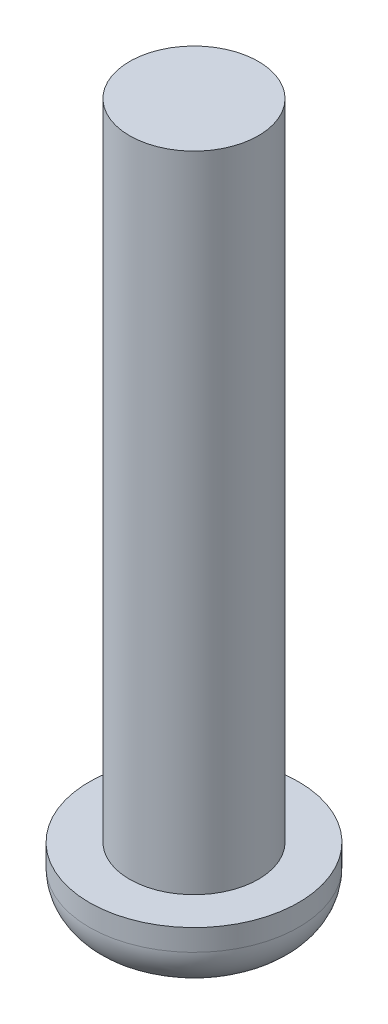
ISO-10303-21;
HEADER;
FILE_DESCRIPTION(('STEP AP214'),'2;1');
FILE_NAME('part.step','',(''),(''),'','','');
FILE_SCHEMA(('AUTOMOTIVE_DESIGN { 1 0 10303 214 1 1 1 1 }'));
ENDSEC;
DATA;
#1=APPLICATION_CONTEXT('core data for automotive mechanical design processes');
#2=APPLICATION_PROTOCOL_DEFINITION('international standard','automotive_design',2000,#1);
#3=PRODUCT_CONTEXT('',#1,'mechanical');
#4=PRODUCT('Part','Part','',(#3));
#5=PRODUCT_RELATED_PRODUCT_CATEGORY('part','',(#4));
#6=PRODUCT_DEFINITION_FORMATION('','',#4);
#7=PRODUCT_DEFINITION_CONTEXT('part definition',#1,'design');
#8=PRODUCT_DEFINITION('design','',#6,#7);
#9=PRODUCT_DEFINITION_SHAPE('','',#8);
#10=(LENGTH_UNIT() NAMED_UNIT(*) SI_UNIT(.MILLI.,.METRE.));
#11=(NAMED_UNIT(*) PLANE_ANGLE_UNIT() SI_UNIT($,.RADIAN.));
#12=(NAMED_UNIT(*) SI_UNIT($,.STERADIAN.) SOLID_ANGLE_UNIT());
#13=UNCERTAINTY_MEASURE_WITH_UNIT(LENGTH_MEASURE(1.E-05),#10,'distance_accuracy_value','');
#14=(GEOMETRIC_REPRESENTATION_CONTEXT(3) GLOBAL_UNCERTAINTY_ASSIGNED_CONTEXT((#13)) GLOBAL_UNIT_ASSIGNED_CONTEXT((#10,
#11,#12)) REPRESENTATION_CONTEXT('',''));
#15=CARTESIAN_POINT('',(0.,0.,0.));
#16=DIRECTION('',(0.,0.,1.));
#17=DIRECTION('',(1.,0.,0.));
#18=AXIS2_PLACEMENT_3D('',#15,#16,#17);
#19=CARTESIAN_POINT('',(30.,4.,0.));
#20=DIRECTION('',(0.,-1.,0.));
#21=DIRECTION('',(0.,0.,-1.));
#22=AXIS2_PLACEMENT_3D('',#19,#20,#21);
#23=CYLINDRICAL_SURFACE('',#22,6.5);
#24=CARTESIAN_POINT('',(30.,2.66666666666668,0.));
#25=DIRECTION('',(0.,-1.,0.));
#26=DIRECTION('',(0.,0.,-1.));
#27=AXIS2_PLACEMENT_3D('',#24,#25,#26);
#28=CIRCLE('',#27,6.5);
#29=CARTESIAN_POINT('',(30.,2.66666666666668,-6.5));
#30=VERTEX_POINT('',#29);
#31=EDGE_CURVE('E11',#30,#30,#28,.F.);
#32=ORIENTED_EDGE('',*,*,#31,.T.);
#33=EDGE_LOOP('',(#32));
#34=FACE_BOUND('',#33,.T.);
#35=CARTESIAN_POINT('',(30.,4.,0.));
#36=DIRECTION('',(0.,-1.,0.));
#37=DIRECTION('',(0.,0.,-1.));
#38=AXIS2_PLACEMENT_3D('',#35,#36,#37);
#39=CIRCLE('',#38,6.5);
#40=CARTESIAN_POINT('',(30.,4.,-6.5));
#41=VERTEX_POINT('',#40);
#42=EDGE_CURVE('E144',#41,#41,#39,.T.);
#43=ORIENTED_EDGE('',*,*,#42,.T.);
#44=EDGE_LOOP('',(#43));
#45=FACE_BOUND('',#44,.T.);
#46=ADVANCED_FACE('F33',(#34,#45),#23,.T.);
#47=CARTESIAN_POINT('',(36.5,4.,0.));
#48=DIRECTION('',(0.,1.,0.));
#49=DIRECTION('',(0.,0.,1.));
#50=AXIS2_PLACEMENT_3D('',#47,#48,#49);
#51=PLANE('',#50);
#52=CARTESIAN_POINT('',(30.,4.,0.));
#53=DIRECTION('',(0.,1.,0.));
#54=DIRECTION('',(0.,0.,1.));
#55=AXIS2_PLACEMENT_3D('',#52,#53,#54);
#56=CIRCLE('',#55,4.);
#57=CARTESIAN_POINT('',(30.,4.,4.));
#58=VERTEX_POINT('',#57);
#59=EDGE_CURVE('E135',#58,#58,#56,.T.);
#60=ORIENTED_EDGE('',*,*,#59,.F.);
#61=EDGE_LOOP('',(#60));
#62=FACE_BOUND('',#61,.T.);
#63=ORIENTED_EDGE('',*,*,#42,.F.);
#64=EDGE_LOOP('',(#63));
#65=FACE_BOUND('',#64,.T.);
#66=ADVANCED_FACE('F163',(#62,#65),#51,.T.);
#67=CARTESIAN_POINT('',(30.,0.,0.));
#68=DIRECTION('',(0.,-1.,0.));
#69=DIRECTION('',(0.,0.,-1.));
#70=AXIS2_PLACEMENT_3D('',#67,#68,#69);
#71=PLANE('',#70);
#72=CARTESIAN_POINT('',(30.,0.,0.));
#73=DIRECTION('',(0.,-1.,0.));
#74=DIRECTION('',(0.,0.,-1.));
#75=AXIS2_PLACEMENT_3D('',#72,#73,#74);
#76=CIRCLE('',#75,3.83333333333332);
#77=CARTESIAN_POINT('',(30.,0.,-3.83333333333332));
#78=VERTEX_POINT('',#77);
#79=EDGE_CURVE('E41',#78,#78,#76,.T.);
#80=ORIENTED_EDGE('',*,*,#79,.T.);
#81=EDGE_LOOP('',(#80));
#82=FACE_BOUND('',#81,.T.);
#83=DIRECTION('',(0.5,0.,-0.866025403784438));
#84=VECTOR('',#83,1.);
#85=CARTESIAN_POINT('',(27.5,0.,0.));
#86=LINE('',#85,#84);
#87=CARTESIAN_POINT('',(27.5,0.,0.));
#88=VERTEX_POINT('',#87);
#89=CARTESIAN_POINT('',(28.75,0.,-2.1650635094611));
#90=VERTEX_POINT('',#89);
#91=EDGE_CURVE('E48',#88,#90,#86,.T.);
#92=ORIENTED_EDGE('',*,*,#91,.F.);
#93=DIRECTION('',(-0.499999999999999,0.,-0.866025403784439));
#94=VECTOR('',#93,1.);
#95=CARTESIAN_POINT('',(28.75,0.,2.1650635094611));
#96=LINE('',#95,#94);
#97=CARTESIAN_POINT('',(28.75,0.,2.1650635094611));
#98=VERTEX_POINT('',#97);
#99=EDGE_CURVE('E131',#98,#88,#96,.T.);
#100=ORIENTED_EDGE('',*,*,#99,.F.);
#101=DIRECTION('',(-1.,0.,0.));
#102=VECTOR('',#101,1.);
#103=CARTESIAN_POINT('',(31.25,0.,2.1650635094611));
#104=LINE('',#103,#102);
#105=CARTESIAN_POINT('',(31.25,0.,2.1650635094611));
#106=VERTEX_POINT('',#105);
#107=EDGE_CURVE('E129',#106,#98,#104,.T.);
#108=ORIENTED_EDGE('',*,*,#107,.F.);
#109=DIRECTION('',(-0.5,0.,0.866025403784438));
#110=VECTOR('',#109,1.);
#111=CARTESIAN_POINT('',(32.5,0.,0.));
#112=LINE('',#111,#110);
#113=CARTESIAN_POINT('',(32.5,0.,0.));
#114=VERTEX_POINT('',#113);
#115=EDGE_CURVE('E96',#114,#106,#112,.T.);
#116=ORIENTED_EDGE('',*,*,#115,.F.);
#117=DIRECTION('',(0.499999999999999,0.,0.866025403784439));
#118=VECTOR('',#117,1.);
#119=CARTESIAN_POINT('',(31.25,0.,-2.1650635094611));
#120=LINE('',#119,#118);
#121=CARTESIAN_POINT('',(31.25,0.,-2.1650635094611));
#122=VERTEX_POINT('',#121);
#123=EDGE_CURVE('E125',#122,#114,#120,.T.);
#124=ORIENTED_EDGE('',*,*,#123,.F.);
#125=DIRECTION('',(1.,0.,0.));
#126=VECTOR('',#125,1.);
#127=CARTESIAN_POINT('',(28.75,0.,-2.1650635094611));
#128=LINE('',#127,#126);
#129=EDGE_CURVE('E122',#90,#122,#128,.T.);
#130=ORIENTED_EDGE('',*,*,#129,.F.);
#131=EDGE_LOOP('',(#92,#100,#108,#116,#124,#130));
#132=FACE_BOUND('',#131,.T.);
#133=ADVANCED_FACE('F151',(#82,#132),#71,.T.);
#134=CARTESIAN_POINT('',(30.,44.,0.));
#135=DIRECTION('',(0.,-1.,0.));
#136=DIRECTION('',(0.,0.,-1.));
#137=AXIS2_PLACEMENT_3D('',#134,#135,#136);
#138=CYLINDRICAL_SURFACE('',#137,4.);
#139=CARTESIAN_POINT('',(30.,44.,0.));
#140=DIRECTION('',(0.,1.,0.));
#141=DIRECTION('',(0.,0.,1.));
#142=AXIS2_PLACEMENT_3D('',#139,#140,#141);
#143=CIRCLE('',#142,4.);
#144=CARTESIAN_POINT('',(30.,44.,4.));
#145=VERTEX_POINT('',#144);
#146=EDGE_CURVE('E141',#145,#145,#143,.T.);
#147=ORIENTED_EDGE('',*,*,#146,.F.);
#148=EDGE_LOOP('',(#147));
#149=FACE_BOUND('',#148,.T.);
#150=ORIENTED_EDGE('',*,*,#59,.T.);
#151=EDGE_LOOP('',(#150));
#152=FACE_BOUND('',#151,.T.);
#153=ADVANCED_FACE('F174',(#149,#152),#138,.T.);
#154=CARTESIAN_POINT('',(30.,44.,0.));
#155=DIRECTION('',(0.,1.,0.));
#156=DIRECTION('',(0.,0.,1.));
#157=AXIS2_PLACEMENT_3D('',#154,#155,#156);
#158=PLANE('',#157);
#159=ORIENTED_EDGE('',*,*,#146,.T.);
#160=EDGE_LOOP('',(#159));
#161=FACE_BOUND('',#160,.T.);
#162=ADVANCED_FACE('F177',(#161),#158,.T.);
#163=CARTESIAN_POINT('',(27.5,2.,0.));
#164=DIRECTION('',(-0.866025403784438,0.,-0.5));
#165=DIRECTION('',(-0.5,0.,0.866025403784438));
#166=AXIS2_PLACEMENT_3D('',#163,#164,#165);
#167=PLANE('',#166);
#168=ORIENTED_EDGE('',*,*,#91,.T.);
#169=DIRECTION('',(0.,-1.,0.));
#170=VECTOR('',#169,1.);
#171=CARTESIAN_POINT('',(28.75,2.,-2.1650635094611));
#172=LINE('',#171,#170);
#173=CARTESIAN_POINT('',(28.75,2.,-2.1650635094611));
#174=VERTEX_POINT('',#173);
#175=EDGE_CURVE('E78',#174,#90,#172,.T.);
#176=ORIENTED_EDGE('',*,*,#175,.F.);
#177=DIRECTION('',(0.5,0.,-0.866025403784438));
#178=VECTOR('',#177,1.);
#179=CARTESIAN_POINT('',(27.5,2.,0.));
#180=LINE('',#179,#178);
#181=CARTESIAN_POINT('',(27.5,2.,0.));
#182=VERTEX_POINT('',#181);
#183=EDGE_CURVE('E133',#182,#174,#180,.T.);
#184=ORIENTED_EDGE('',*,*,#183,.F.);
#185=DIRECTION('',(0.,-1.,0.));
#186=VECTOR('',#185,1.);
#187=CARTESIAN_POINT('',(27.5,2.,0.));
#188=LINE('',#187,#186);
#189=EDGE_CURVE('E56',#182,#88,#188,.T.);
#190=ORIENTED_EDGE('',*,*,#189,.T.);
#191=EDGE_LOOP('',(#168,#176,#184,#190));
#192=FACE_BOUND('',#191,.T.);
#193=ADVANCED_FACE('F181',(#192),#167,.F.);
#194=CARTESIAN_POINT('',(28.75,2.,2.1650635094611));
#195=DIRECTION('',(-0.866025403784439,0.,0.499999999999999));
#196=DIRECTION('',(0.499999999999999,0.,0.866025403784439));
#197=AXIS2_PLACEMENT_3D('',#194,#195,#196);
#198=PLANE('',#197);
#199=ORIENTED_EDGE('',*,*,#99,.T.);
#200=ORIENTED_EDGE('',*,*,#189,.F.);
#201=DIRECTION('',(-0.499999999999999,0.,-0.866025403784439));
#202=VECTOR('',#201,1.);
#203=CARTESIAN_POINT('',(28.75,2.,2.1650635094611));
#204=LINE('',#203,#202);
#205=CARTESIAN_POINT('',(28.75,2.,2.1650635094611));
#206=VERTEX_POINT('',#205);
#207=EDGE_CURVE('E108',#206,#182,#204,.T.);
#208=ORIENTED_EDGE('',*,*,#207,.F.);
#209=DIRECTION('',(0.,-1.,0.));
#210=VECTOR('',#209,1.);
#211=CARTESIAN_POINT('',(28.75,2.,2.1650635094611));
#212=LINE('',#211,#210);
#213=EDGE_CURVE('E100',#206,#98,#212,.T.);
#214=ORIENTED_EDGE('',*,*,#213,.T.);
#215=EDGE_LOOP('',(#199,#200,#208,#214));
#216=FACE_BOUND('',#215,.T.);
#217=ADVANCED_FACE('F185',(#216),#198,.F.);
#218=CARTESIAN_POINT('',(31.25,2.,2.1650635094611));
#219=DIRECTION('',(0.,0.,1.));
#220=DIRECTION('',(1.,0.,0.));
#221=AXIS2_PLACEMENT_3D('',#218,#219,#220);
#222=PLANE('',#221);
#223=ORIENTED_EDGE('',*,*,#107,.T.);
#224=ORIENTED_EDGE('',*,*,#213,.F.);
#225=DIRECTION('',(-1.,0.,0.));
#226=VECTOR('',#225,1.);
#227=CARTESIAN_POINT('',(31.25,2.,2.1650635094611));
#228=LINE('',#227,#226);
#229=CARTESIAN_POINT('',(31.25,2.,2.1650635094611));
#230=VERTEX_POINT('',#229);
#231=EDGE_CURVE('E104',#230,#206,#228,.T.);
#232=ORIENTED_EDGE('',*,*,#231,.F.);
#233=DIRECTION('',(0.,-1.,0.));
#234=VECTOR('',#233,1.);
#235=CARTESIAN_POINT('',(31.25,2.,2.1650635094611));
#236=LINE('',#235,#234);
#237=EDGE_CURVE('E89',#230,#106,#236,.T.);
#238=ORIENTED_EDGE('',*,*,#237,.T.);
#239=EDGE_LOOP('',(#223,#224,#232,#238));
#240=FACE_BOUND('',#239,.T.);
#241=ADVANCED_FACE('F105',(#240),#222,.F.);
#242=CARTESIAN_POINT('',(32.5,2.,0.));
#243=DIRECTION('',(0.866025403784439,0.,0.5));
#244=DIRECTION('',(0.5,0.,-0.866025403784438));
#245=AXIS2_PLACEMENT_3D('',#242,#243,#244);
#246=PLANE('',#245);
#247=ORIENTED_EDGE('',*,*,#115,.T.);
#248=ORIENTED_EDGE('',*,*,#237,.F.);
#249=DIRECTION('',(-0.5,0.,0.866025403784438));
#250=VECTOR('',#249,1.);
#251=CARTESIAN_POINT('',(32.5,2.,0.));
#252=LINE('',#251,#250);
#253=CARTESIAN_POINT('',(32.5,2.,0.));
#254=VERTEX_POINT('',#253);
#255=EDGE_CURVE('E93',#254,#230,#252,.T.);
#256=ORIENTED_EDGE('',*,*,#255,.F.);
#257=DIRECTION('',(0.,-1.,0.));
#258=VECTOR('',#257,1.);
#259=CARTESIAN_POINT('',(32.5,2.,0.));
#260=LINE('',#259,#258);
#261=EDGE_CURVE('E101',#254,#114,#260,.T.);
#262=ORIENTED_EDGE('',*,*,#261,.T.);
#263=EDGE_LOOP('',(#247,#248,#256,#262));
#264=FACE_BOUND('',#263,.T.);
#265=ADVANCED_FACE('F91',(#264),#246,.F.);
#266=CARTESIAN_POINT('',(31.25,2.,-2.1650635094611));
#267=DIRECTION('',(0.866025403784439,0.,-0.499999999999999));
#268=DIRECTION('',(-0.499999999999999,0.,-0.866025403784439));
#269=AXIS2_PLACEMENT_3D('',#266,#267,#268);
#270=PLANE('',#269);
#271=ORIENTED_EDGE('',*,*,#123,.T.);
#272=ORIENTED_EDGE('',*,*,#261,.F.);
#273=DIRECTION('',(0.499999999999999,0.,0.866025403784439));
#274=VECTOR('',#273,1.);
#275=CARTESIAN_POINT('',(31.25,2.,-2.1650635094611));
#276=LINE('',#275,#274);
#277=CARTESIAN_POINT('',(31.25,2.,-2.1650635094611));
#278=VERTEX_POINT('',#277);
#279=EDGE_CURVE('E114',#278,#254,#276,.T.);
#280=ORIENTED_EDGE('',*,*,#279,.F.);
#281=DIRECTION('',(0.,-1.,0.));
#282=VECTOR('',#281,1.);
#283=CARTESIAN_POINT('',(31.25,2.,-2.1650635094611));
#284=LINE('',#283,#282);
#285=EDGE_CURVE('E138',#278,#122,#284,.T.);
#286=ORIENTED_EDGE('',*,*,#285,.T.);
#287=EDGE_LOOP('',(#271,#272,#280,#286));
#288=FACE_BOUND('',#287,.T.);
#289=ADVANCED_FACE('F188',(#288),#270,.F.);
#290=CARTESIAN_POINT('',(28.75,2.,-2.1650635094611));
#291=DIRECTION('',(0.,0.,-1.));
#292=DIRECTION('',(-1.,0.,0.));
#293=AXIS2_PLACEMENT_3D('',#290,#291,#292);
#294=PLANE('',#293);
#295=ORIENTED_EDGE('',*,*,#129,.T.);
#296=ORIENTED_EDGE('',*,*,#285,.F.);
#297=DIRECTION('',(1.,0.,0.));
#298=VECTOR('',#297,1.);
#299=CARTESIAN_POINT('',(28.75,2.,-2.1650635094611));
#300=LINE('',#299,#298);
#301=EDGE_CURVE('E116',#174,#278,#300,.T.);
#302=ORIENTED_EDGE('',*,*,#301,.F.);
#303=ORIENTED_EDGE('',*,*,#175,.T.);
#304=EDGE_LOOP('',(#295,#296,#302,#303));
#305=FACE_BOUND('',#304,.T.);
#306=ADVANCED_FACE('F159',(#305),#294,.F.);
#307=CARTESIAN_POINT('',(0.,2.,0.));
#308=DIRECTION('',(0.,-1.,0.));
#309=DIRECTION('',(0.,0.,-1.));
#310=AXIS2_PLACEMENT_3D('',#307,#308,#309);
#311=PLANE('',#310);
#312=ORIENTED_EDGE('',*,*,#183,.T.);
#313=ORIENTED_EDGE('',*,*,#301,.T.);
#314=ORIENTED_EDGE('',*,*,#279,.T.);
#315=ORIENTED_EDGE('',*,*,#255,.T.);
#316=ORIENTED_EDGE('',*,*,#231,.T.);
#317=ORIENTED_EDGE('',*,*,#207,.T.);
#318=EDGE_LOOP('',(#312,#313,#314,#315,#316,#317));
#319=FACE_BOUND('',#318,.T.);
#320=ADVANCED_FACE('F111',(#319),#311,.T.);
#321=CARTESIAN_POINT('',(30.,2.66666666666668,0.));
#322=DIRECTION('',(0.,-1.,0.));
#323=DIRECTION('',(0.,0.,-1.));
#324=AXIS2_PLACEMENT_3D('',#321,#322,#323);
#325=TOROIDAL_SURFACE('',#324,3.83333333333332,2.66666666666668);
#326=ORIENTED_EDGE('',*,*,#31,.F.);
#327=EDGE_LOOP('',(#326));
#328=FACE_BOUND('',#327,.T.);
#329=ORIENTED_EDGE('',*,*,#79,.F.);
#330=EDGE_LOOP('',(#329));
#331=FACE_BOUND('',#330,.T.);
#332=ADVANCED_FACE('F35',(#328,#331),#325,.T.);
#333=CLOSED_SHELL('',(#46,#66,#133,#153,#162,#193,#217,#241,#265,#289,#306,#320,#332));
#334=MANIFOLD_SOLID_BREP('B2',#333);
#335=ADVANCED_BREP_SHAPE_REPRESENTATION('',(#18,#334),#14);
#336=SHAPE_DEFINITION_REPRESENTATION(#9,#335);
ENDSEC;
END-ISO-10303-21;
